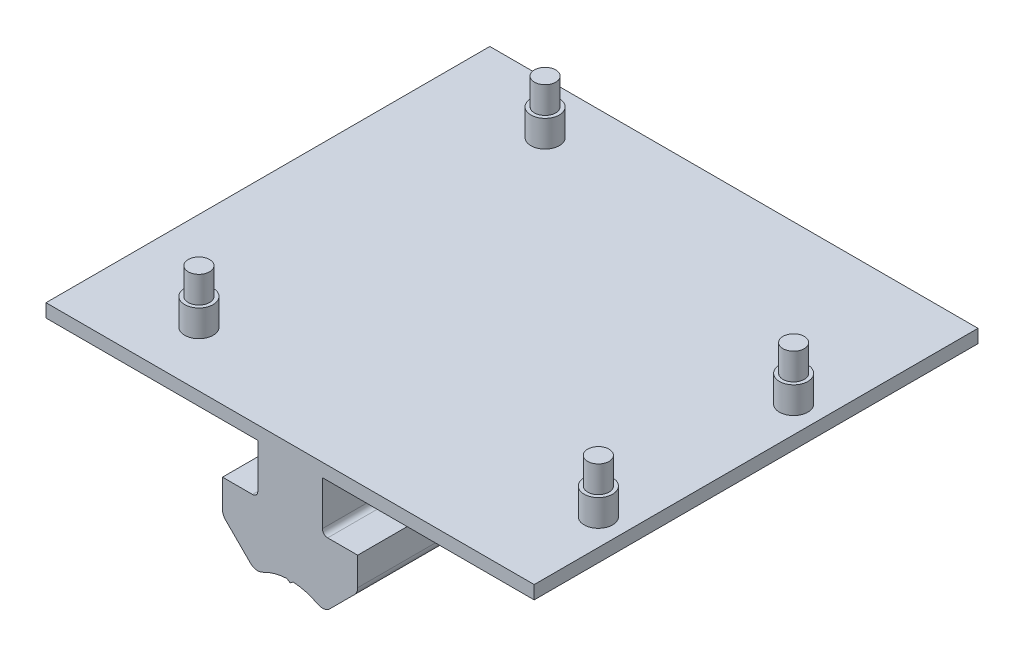
ISO-10303-21;
HEADER;
FILE_DESCRIPTION(('STEP AP214'),'2;1');
FILE_NAME('part.step','',(''),(''),'','','');
FILE_SCHEMA(('AUTOMOTIVE_DESIGN { 1 0 10303 214 1 1 1 1 }'));
ENDSEC;
DATA;
#1=APPLICATION_CONTEXT('core data for automotive mechanical design processes');
#2=APPLICATION_PROTOCOL_DEFINITION('international standard','automotive_design',2000,#1);
#3=PRODUCT_CONTEXT('',#1,'mechanical');
#4=PRODUCT('Part','Part','',(#3));
#5=PRODUCT_RELATED_PRODUCT_CATEGORY('part','',(#4));
#6=PRODUCT_DEFINITION_FORMATION('','',#4);
#7=PRODUCT_DEFINITION_CONTEXT('part definition',#1,'design');
#8=PRODUCT_DEFINITION('design','',#6,#7);
#9=PRODUCT_DEFINITION_SHAPE('','',#8);
#10=(LENGTH_UNIT() NAMED_UNIT(*) SI_UNIT(.MILLI.,.METRE.));
#11=(NAMED_UNIT(*) PLANE_ANGLE_UNIT() SI_UNIT($,.RADIAN.));
#12=(NAMED_UNIT(*) SI_UNIT($,.STERADIAN.) SOLID_ANGLE_UNIT());
#13=UNCERTAINTY_MEASURE_WITH_UNIT(LENGTH_MEASURE(1.E-05),#10,'distance_accuracy_value','');
#14=(GEOMETRIC_REPRESENTATION_CONTEXT(3) GLOBAL_UNCERTAINTY_ASSIGNED_CONTEXT((#13)) GLOBAL_UNIT_ASSIGNED_CONTEXT((#10,
#11,#12)) REPRESENTATION_CONTEXT('',''));
#15=CARTESIAN_POINT('',(0.,0.,0.));
#16=DIRECTION('',(0.,0.,1.));
#17=DIRECTION('',(1.,0.,0.));
#18=AXIS2_PLACEMENT_3D('',#15,#16,#17);
#19=CARTESIAN_POINT('',(-15.7881502716479,70.5217865494155,370.226101294247));
#20=DIRECTION('',(-1.,0.,0.));
#21=DIRECTION('',(0.,0.,1.));
#22=AXIS2_PLACEMENT_3D('',#19,#20,#21);
#23=PLANE('',#22);
#24=DIRECTION('',(0.,-1.,0.));
#25=VECTOR('',#24,1.);
#26=CARTESIAN_POINT('',(-15.7881502716479,70.5217865494155,433.726101294247));
#27=LINE('',#26,#25);
#28=CARTESIAN_POINT('',(-15.7881502716479,72.4267865494155,433.726101294247));
#29=VERTEX_POINT('',#28);
#30=CARTESIAN_POINT('',(-15.7881502716479,70.5217865494155,433.726101294247));
#31=VERTEX_POINT('',#30);
#32=EDGE_CURVE('E226',#29,#31,#27,.T.);
#33=ORIENTED_EDGE('',*,*,#32,.F.);
#34=DIRECTION('',(0.,0.,1.));
#35=VECTOR('',#34,1.);
#36=CARTESIAN_POINT('',(-15.7881502716479,72.4267865494155,370.226101294247));
#37=LINE('',#36,#35);
#38=CARTESIAN_POINT('',(-15.7881502716479,72.4267865494155,370.226101294247));
#39=VERTEX_POINT('',#38);
#40=EDGE_CURVE('E11',#39,#29,#37,.T.);
#41=ORIENTED_EDGE('',*,*,#40,.F.);
#42=DIRECTION('',(0.,-1.,0.));
#43=VECTOR('',#42,1.);
#44=CARTESIAN_POINT('',(-15.7881502716479,70.5217865494155,370.226101294247));
#45=LINE('',#44,#43);
#46=CARTESIAN_POINT('',(-15.7881502716479,70.5217865494155,370.226101294247));
#47=VERTEX_POINT('',#46);
#48=EDGE_CURVE('E292',#39,#47,#45,.T.);
#49=ORIENTED_EDGE('',*,*,#48,.T.);
#50=DIRECTION('',(0.,0.,1.));
#51=VECTOR('',#50,1.);
#52=CARTESIAN_POINT('',(-15.7881502716479,70.5217865494155,370.226101294247));
#53=LINE('',#52,#51);
#54=EDGE_CURVE('E139',#47,#31,#53,.T.);
#55=ORIENTED_EDGE('',*,*,#54,.T.);
#56=EDGE_LOOP('',(#33,#41,#49,#55));
#57=FACE_BOUND('',#56,.T.);
#58=ADVANCED_FACE('F38',(#57),#23,.T.);
#59=CARTESIAN_POINT('',(-15.7881502716479,72.4267865494155,370.226101294247));
#60=DIRECTION('',(0.,1.,0.));
#61=DIRECTION('',(0.,0.,1.));
#62=AXIS2_PLACEMENT_3D('',#59,#60,#61);
#63=PLANE('',#62);
#64=CARTESIAN_POINT('',(-1.81815027164785,72.4267865494155,425.814863045515));
#65=DIRECTION('',(0.,1.,0.));
#66=DIRECTION('',(0.,0.,1.));
#67=AXIS2_PLACEMENT_3D('',#64,#65,#66);
#68=CIRCLE('',#67,2.03200000000004);
#69=CARTESIAN_POINT('',(-1.81815027164785,72.4267865494155,427.846863045515));
#70=VERTEX_POINT('',#69);
#71=EDGE_CURVE('E629',#70,#70,#68,.T.);
#72=ORIENTED_EDGE('',*,*,#71,.F.);
#73=EDGE_LOOP('',(#72));
#74=FACE_BOUND('',#73,.T.);
#75=CARTESIAN_POINT('',(50.2518497283521,72.4267865494155,420.734863045515));
#76=DIRECTION('',(0.,1.,0.));
#77=DIRECTION('',(0.,0.,1.));
#78=AXIS2_PLACEMENT_3D('',#75,#76,#77);
#79=CIRCLE('',#78,2.03199999999995);
#80=CARTESIAN_POINT('',(50.2518497283521,72.4267865494155,422.766863045515));
#81=VERTEX_POINT('',#80);
#82=EDGE_CURVE('E348',#81,#81,#79,.T.);
#83=ORIENTED_EDGE('',*,*,#82,.F.);
#84=EDGE_LOOP('',(#83));
#85=FACE_BOUND('',#84,.T.);
#86=CARTESIAN_POINT('',(50.2518497283521,72.4267865494155,392.794863045515));
#87=DIRECTION('',(0.,1.,0.));
#88=DIRECTION('',(0.,0.,1.));
#89=AXIS2_PLACEMENT_3D('',#86,#87,#88);
#90=CIRCLE('',#89,2.03199999999995);
#91=CARTESIAN_POINT('',(50.2518497283521,72.4267865494155,394.826863045515));
#92=VERTEX_POINT('',#91);
#93=EDGE_CURVE('E344',#92,#92,#90,.T.);
#94=ORIENTED_EDGE('',*,*,#93,.F.);
#95=EDGE_LOOP('',(#94));
#96=FACE_BOUND('',#95,.T.);
#97=CARTESIAN_POINT('',(-0.548150271647851,72.4267865494155,377.554863045515));
#98=DIRECTION('',(0.,1.,0.));
#99=DIRECTION('',(0.,0.,1.));
#100=AXIS2_PLACEMENT_3D('',#97,#98,#99);
#101=CIRCLE('',#100,2.03200000000004);
#102=CARTESIAN_POINT('',(-0.548150271647851,72.4267865494155,379.586863045515));
#103=VERTEX_POINT('',#102);
#104=EDGE_CURVE('E343',#103,#103,#101,.T.);
#105=ORIENTED_EDGE('',*,*,#104,.F.);
#106=EDGE_LOOP('',(#105));
#107=FACE_BOUND('',#106,.T.);
#108=DIRECTION('',(-1.,0.,0.));
#109=VECTOR('',#108,1.);
#110=CARTESIAN_POINT('',(-15.7881502716479,72.4267865494155,433.726101294247));
#111=LINE('',#110,#109);
#112=CARTESIAN_POINT('',(54.0618497283522,72.4267865494155,433.726101294247));
#113=VERTEX_POINT('',#112);
#114=EDGE_CURVE('E290',#113,#29,#111,.T.);
#115=ORIENTED_EDGE('',*,*,#114,.F.);
#116=DIRECTION('',(0.,0.,1.));
#117=VECTOR('',#116,1.);
#118=CARTESIAN_POINT('',(54.0618497283522,72.4267865494155,370.226101294247));
#119=LINE('',#118,#117);
#120=CARTESIAN_POINT('',(54.0618497283522,72.4267865494155,370.226101294247));
#121=VERTEX_POINT('',#120);
#122=EDGE_CURVE('E47',#121,#113,#119,.T.);
#123=ORIENTED_EDGE('',*,*,#122,.F.);
#124=DIRECTION('',(-1.,0.,0.));
#125=VECTOR('',#124,1.);
#126=CARTESIAN_POINT('',(-15.7881502716479,72.4267865494155,370.226101294247));
#127=LINE('',#126,#125);
#128=EDGE_CURVE('E215',#121,#39,#127,.T.);
#129=ORIENTED_EDGE('',*,*,#128,.T.);
#130=ORIENTED_EDGE('',*,*,#40,.T.);
#131=EDGE_LOOP('',(#115,#123,#129,#130));
#132=FACE_BOUND('',#131,.T.);
#133=ADVANCED_FACE('F500',(#74,#85,#96,#107,#132),#63,.T.);
#134=CARTESIAN_POINT('',(54.0618497283522,72.4267865494155,370.226101294247));
#135=DIRECTION('',(1.,0.,0.));
#136=DIRECTION('',(0.,0.,-1.));
#137=AXIS2_PLACEMENT_3D('',#134,#135,#136);
#138=PLANE('',#137);
#139=DIRECTION('',(0.,1.,0.));
#140=VECTOR('',#139,1.);
#141=CARTESIAN_POINT('',(54.0618497283522,72.4267865494155,433.726101294247));
#142=LINE('',#141,#140);
#143=CARTESIAN_POINT('',(54.0618497283522,70.5217865494155,433.726101294247));
#144=VERTEX_POINT('',#143);
#145=EDGE_CURVE('E203',#144,#113,#142,.T.);
#146=ORIENTED_EDGE('',*,*,#145,.F.);
#147=DIRECTION('',(0.,0.,1.));
#148=VECTOR('',#147,1.);
#149=CARTESIAN_POINT('',(54.0618497283522,70.5217865494155,370.226101294247));
#150=LINE('',#149,#148);
#151=CARTESIAN_POINT('',(54.0618497283522,70.5217865494155,370.226101294247));
#152=VERTEX_POINT('',#151);
#153=EDGE_CURVE('E198',#152,#144,#150,.T.);
#154=ORIENTED_EDGE('',*,*,#153,.F.);
#155=DIRECTION('',(0.,1.,0.));
#156=VECTOR('',#155,1.);
#157=CARTESIAN_POINT('',(54.0618497283522,72.4267865494155,370.226101294247));
#158=LINE('',#157,#156);
#159=EDGE_CURVE('E201',#152,#121,#158,.T.);
#160=ORIENTED_EDGE('',*,*,#159,.T.);
#161=ORIENTED_EDGE('',*,*,#122,.T.);
#162=EDGE_LOOP('',(#146,#154,#160,#161));
#163=FACE_BOUND('',#162,.T.);
#164=ADVANCED_FACE('F200',(#163),#138,.T.);
#165=CARTESIAN_POINT('',(54.0618497283522,70.5217865494155,370.226101294247));
#166=DIRECTION('',(0.,-1.,0.));
#167=DIRECTION('',(0.,0.,-1.));
#168=AXIS2_PLACEMENT_3D('',#165,#166,#167);
#169=PLANE('',#168);
#170=DIRECTION('',(1.,0.,0.));
#171=VECTOR('',#170,1.);
#172=CARTESIAN_POINT('',(54.0618497283522,70.5217865494155,433.726101294247));
#173=LINE('',#172,#171);
#174=CARTESIAN_POINT('',(23.7558497283522,70.5217865494155,433.726101294247));
#175=VERTEX_POINT('',#174);
#176=EDGE_CURVE('E287',#175,#144,#173,.T.);
#177=ORIENTED_EDGE('',*,*,#176,.F.);
#178=DIRECTION('',(0.,0.,1.));
#179=VECTOR('',#178,1.);
#180=CARTESIAN_POINT('',(23.7558497283522,70.5217865494155,370.226101294247));
#181=LINE('',#180,#179);
#182=CARTESIAN_POINT('',(23.7558497283522,70.5217865494155,370.226101294247));
#183=VERTEX_POINT('',#182);
#184=EDGE_CURVE('E208',#183,#175,#181,.T.);
#185=ORIENTED_EDGE('',*,*,#184,.F.);
#186=DIRECTION('',(1.,0.,0.));
#187=VECTOR('',#186,1.);
#188=CARTESIAN_POINT('',(54.0618497283522,70.5217865494155,370.226101294247));
#189=LINE('',#188,#187);
#190=EDGE_CURVE('E214',#183,#152,#189,.T.);
#191=ORIENTED_EDGE('',*,*,#190,.T.);
#192=ORIENTED_EDGE('',*,*,#153,.T.);
#193=EDGE_LOOP('',(#177,#185,#191,#192));
#194=FACE_BOUND('',#193,.T.);
#195=ADVANCED_FACE('F218',(#194),#169,.T.);
#196=CARTESIAN_POINT('',(23.7558497283522,70.5217865494155,370.226101294247));
#197=DIRECTION('',(1.,0.,0.));
#198=DIRECTION('',(0.,0.,-1.));
#199=AXIS2_PLACEMENT_3D('',#196,#197,#198);
#200=PLANE('',#199);
#201=DIRECTION('',(0.,1.,0.));
#202=VECTOR('',#201,1.);
#203=CARTESIAN_POINT('',(23.7558497283522,70.5217865494155,433.726101294247));
#204=LINE('',#203,#202);
#205=CARTESIAN_POINT('',(23.7558497283522,64.1972865494153,433.726101294247));
#206=VERTEX_POINT('',#205);
#207=EDGE_CURVE('E284',#206,#175,#204,.T.);
#208=ORIENTED_EDGE('',*,*,#207,.F.);
#209=DIRECTION('',(0.,0.,1.));
#210=VECTOR('',#209,1.);
#211=CARTESIAN_POINT('',(23.7558497283522,64.1972865494153,370.226101294247));
#212=LINE('',#211,#210);
#213=CARTESIAN_POINT('',(23.7558497283522,64.1972865494153,370.226101294247));
#214=VERTEX_POINT('',#213);
#215=EDGE_CURVE('E296',#214,#206,#212,.T.);
#216=ORIENTED_EDGE('',*,*,#215,.F.);
#217=DIRECTION('',(0.,1.,0.));
#218=VECTOR('',#217,1.);
#219=CARTESIAN_POINT('',(23.7558497283522,67.9817865494152,370.226101294247));
#220=LINE('',#219,#218);
#221=EDGE_CURVE('E219',#214,#183,#220,.T.);
#222=ORIENTED_EDGE('',*,*,#221,.T.);
#223=ORIENTED_EDGE('',*,*,#184,.T.);
#224=EDGE_LOOP('',(#208,#216,#222,#223));
#225=FACE_BOUND('',#224,.T.);
#226=ADVANCED_FACE('F516',(#225),#200,.T.);
#227=CARTESIAN_POINT('',(24.5138497283521,64.1972865494153,370.226101294247));
#228=DIRECTION('',(0.,0.,1.));
#229=DIRECTION('',(1.,0.,0.));
#230=AXIS2_PLACEMENT_3D('',#227,#228,#229);
#231=CYLINDRICAL_SURFACE('',#230,0.757999999999995);
#232=CARTESIAN_POINT('',(24.5138497283521,64.1972865494153,433.726101294247));
#233=DIRECTION('',(0.,0.,-1.));
#234=DIRECTION('',(1.,0.,0.));
#235=AXIS2_PLACEMENT_3D('',#232,#233,#234);
#236=CIRCLE('',#235,0.757999999999995);
#237=CARTESIAN_POINT('',(24.5138497283522,63.4392865494153,433.726101294247));
#238=VERTEX_POINT('',#237);
#239=EDGE_CURVE('E281',#238,#206,#236,.T.);
#240=ORIENTED_EDGE('',*,*,#239,.F.);
#241=DIRECTION('',(0.,0.,1.));
#242=VECTOR('',#241,1.);
#243=CARTESIAN_POINT('',(24.5138497283522,63.4392865494153,370.226101294247));
#244=LINE('',#243,#242);
#245=CARTESIAN_POINT('',(24.5138497283522,63.4392865494153,370.226101294247));
#246=VERTEX_POINT('',#245);
#247=EDGE_CURVE('E299',#246,#238,#244,.T.);
#248=ORIENTED_EDGE('',*,*,#247,.F.);
#249=CARTESIAN_POINT('',(24.5138497283521,64.1972865494153,370.226101294247));
#250=DIRECTION('',(0.,0.,-1.));
#251=DIRECTION('',(1.,0.,0.));
#252=AXIS2_PLACEMENT_3D('',#249,#250,#251);
#253=CIRCLE('',#252,0.757999999999995);
#254=EDGE_CURVE('E221',#246,#214,#253,.T.);
#255=ORIENTED_EDGE('',*,*,#254,.T.);
#256=ORIENTED_EDGE('',*,*,#215,.T.);
#257=EDGE_LOOP('',(#240,#248,#255,#256));
#258=FACE_BOUND('',#257,.T.);
#259=ADVANCED_FACE('F432',(#258),#231,.F.);
#260=CARTESIAN_POINT('',(24.5138497283522,63.4392865494153,370.226101294247));
#261=DIRECTION('',(0.,1.,0.));
#262=DIRECTION('',(0.,0.,1.));
#263=AXIS2_PLACEMENT_3D('',#260,#261,#262);
#264=PLANE('',#263);
#265=DIRECTION('',(-1.,0.,0.));
#266=VECTOR('',#265,1.);
#267=CARTESIAN_POINT('',(24.5138497283522,63.4392865494153,433.726101294247));
#268=LINE('',#267,#266);
#269=CARTESIAN_POINT('',(28.8058497283522,63.4392865494153,433.726101294247));
#270=VERTEX_POINT('',#269);
#271=EDGE_CURVE('E278',#270,#238,#268,.T.);
#272=ORIENTED_EDGE('',*,*,#271,.F.);
#273=DIRECTION('',(0.,0.,1.));
#274=VECTOR('',#273,1.);
#275=CARTESIAN_POINT('',(28.8058497283522,63.4392865494153,370.226101294247));
#276=LINE('',#275,#274);
#277=CARTESIAN_POINT('',(28.8058497283522,63.4392865494153,370.226101294247));
#278=VERTEX_POINT('',#277);
#279=EDGE_CURVE('E301',#278,#270,#276,.T.);
#280=ORIENTED_EDGE('',*,*,#279,.F.);
#281=DIRECTION('',(-1.,0.,0.));
#282=VECTOR('',#281,1.);
#283=CARTESIAN_POINT('',(24.5138497283522,63.4392865494153,370.226101294247));
#284=LINE('',#283,#282);
#285=EDGE_CURVE('E426',#278,#246,#284,.T.);
#286=ORIENTED_EDGE('',*,*,#285,.T.);
#287=ORIENTED_EDGE('',*,*,#247,.T.);
#288=EDGE_LOOP('',(#272,#280,#286,#287));
#289=FACE_BOUND('',#288,.T.);
#290=ADVANCED_FACE('F437',(#289),#264,.T.);
#291=CARTESIAN_POINT('',(28.8058497283522,63.4392865494153,370.226101294247));
#292=DIRECTION('',(1.,0.,0.));
#293=DIRECTION('',(0.,0.,-1.));
#294=AXIS2_PLACEMENT_3D('',#291,#292,#293);
#295=PLANE('',#294);
#296=DIRECTION('',(0.,1.,0.));
#297=VECTOR('',#296,1.);
#298=CARTESIAN_POINT('',(28.8058497283522,63.4392865494153,433.726101294247));
#299=LINE('',#298,#297);
#300=CARTESIAN_POINT('',(28.8058497283522,59.4010791144885,433.726101294247));
#301=VERTEX_POINT('',#300);
#302=EDGE_CURVE('E275',#301,#270,#299,.T.);
#303=ORIENTED_EDGE('',*,*,#302,.F.);
#304=DIRECTION('',(0.,0.,1.));
#305=VECTOR('',#304,1.);
#306=CARTESIAN_POINT('',(28.8058497283522,59.4010791144885,370.226101294247));
#307=LINE('',#306,#305);
#308=CARTESIAN_POINT('',(28.8058497283522,59.4010791144885,370.226101294247));
#309=VERTEX_POINT('',#308);
#310=EDGE_CURVE('E303',#309,#301,#307,.T.);
#311=ORIENTED_EDGE('',*,*,#310,.F.);
#312=DIRECTION('',(0.,1.,0.));
#313=VECTOR('',#312,1.);
#314=CARTESIAN_POINT('',(28.8058497283522,63.4392865494153,370.226101294247));
#315=LINE('',#314,#313);
#316=EDGE_CURVE('E423',#309,#278,#315,.T.);
#317=ORIENTED_EDGE('',*,*,#316,.T.);
#318=ORIENTED_EDGE('',*,*,#279,.T.);
#319=EDGE_LOOP('',(#303,#311,#317,#318));
#320=FACE_BOUND('',#319,.T.);
#321=ADVANCED_FACE('F440',(#320),#295,.T.);
#322=CARTESIAN_POINT('',(27.3018497283522,59.4010791144885,370.226101294247));
#323=DIRECTION('',(0.,0.,1.));
#324=DIRECTION('',(1.,0.,0.));
#325=AXIS2_PLACEMENT_3D('',#322,#323,#324);
#326=CYLINDRICAL_SURFACE('',#325,1.504);
#327=CARTESIAN_POINT('',(27.3018497283522,59.4010791144885,433.726101294247));
#328=DIRECTION('',(0.,0.,1.));
#329=DIRECTION('',(1.,0.,0.));
#330=AXIS2_PLACEMENT_3D('',#327,#328,#329);
#331=CIRCLE('',#330,1.504);
#332=CARTESIAN_POINT('',(28.3653383272567,58.337590515584,433.726101294247));
#333=VERTEX_POINT('',#332);
#334=EDGE_CURVE('E272',#333,#301,#331,.T.);
#335=ORIENTED_EDGE('',*,*,#334,.F.);
#336=DIRECTION('',(0.,0.,1.));
#337=VECTOR('',#336,1.);
#338=CARTESIAN_POINT('',(28.3653383272567,58.337590515584,370.226101294247));
#339=LINE('',#338,#337);
#340=CARTESIAN_POINT('',(28.3653383272567,58.337590515584,370.226101294247));
#341=VERTEX_POINT('',#340);
#342=EDGE_CURVE('E305',#341,#333,#339,.T.);
#343=ORIENTED_EDGE('',*,*,#342,.F.);
#344=CARTESIAN_POINT('',(27.3018497283522,59.4010791144885,370.226101294247));
#345=DIRECTION('',(0.,0.,1.));
#346=DIRECTION('',(1.,0.,0.));
#347=AXIS2_PLACEMENT_3D('',#344,#345,#346);
#348=CIRCLE('',#347,1.504);
#349=EDGE_CURVE('E420',#341,#309,#348,.T.);
#350=ORIENTED_EDGE('',*,*,#349,.T.);
#351=ORIENTED_EDGE('',*,*,#310,.T.);
#352=EDGE_LOOP('',(#335,#343,#350,#351));
#353=FACE_BOUND('',#352,.T.);
#354=ADVANCED_FACE('F445',(#353),#326,.T.);
#355=CARTESIAN_POINT('',(28.3653383272567,58.337590515584,370.226101294247));
#356=DIRECTION('',(0.707106781186548,-0.707106781186548,0.));
#357=DIRECTION('',(0.707106781186548,0.707106781186548,0.));
#358=AXIS2_PLACEMENT_3D('',#355,#356,#357);
#359=PLANE('',#358);
#360=DIRECTION('',(0.707106781186547,0.707106781186547,0.));
#361=VECTOR('',#360,1.);
#362=CARTESIAN_POINT('',(28.3653383272567,58.337590515584,433.726101294247));
#363=LINE('',#362,#361);
#364=CARTESIAN_POINT('',(24.8223878072485,54.7946399955758,433.726101294247));
#365=VERTEX_POINT('',#364);
#366=EDGE_CURVE('E269',#365,#333,#363,.T.);
#367=ORIENTED_EDGE('',*,*,#366,.F.);
#368=DIRECTION('',(0.,0.,1.));
#369=VECTOR('',#368,1.);
#370=CARTESIAN_POINT('',(24.8223878072485,54.7946399955758,370.226101294247));
#371=LINE('',#370,#369);
#372=CARTESIAN_POINT('',(24.8223878072485,54.7946399955758,370.226101294247));
#373=VERTEX_POINT('',#372);
#374=EDGE_CURVE('E307',#373,#365,#371,.T.);
#375=ORIENTED_EDGE('',*,*,#374,.F.);
#376=DIRECTION('',(0.707106781186547,0.707106781186547,0.));
#377=VECTOR('',#376,1.);
#378=CARTESIAN_POINT('',(28.3653383272567,58.337590515584,370.226101294247));
#379=LINE('',#378,#377);
#380=EDGE_CURVE('E417',#373,#341,#379,.T.);
#381=ORIENTED_EDGE('',*,*,#380,.T.);
#382=ORIENTED_EDGE('',*,*,#342,.T.);
#383=EDGE_LOOP('',(#367,#375,#381,#382));
#384=FACE_BOUND('',#383,.T.);
#385=ADVANCED_FACE('F448',(#384),#359,.T.);
#386=CARTESIAN_POINT('',(23.758899208344,55.8581285944804,370.226101294247));
#387=DIRECTION('',(0.,0.,1.));
#388=DIRECTION('',(1.,0.,0.));
#389=AXIS2_PLACEMENT_3D('',#386,#387,#388);
#390=CYLINDRICAL_SURFACE('',#389,1.504);
#391=CARTESIAN_POINT('',(23.758899208344,55.8581285944804,433.726101294247));
#392=DIRECTION('',(0.,0.,1.));
#393=DIRECTION('',(1.,0.,0.));
#394=AXIS2_PLACEMENT_3D('',#391,#392,#393);
#395=CIRCLE('',#394,1.504);
#396=CARTESIAN_POINT('',(23.0556556658141,54.5286683581852,433.726101294247));
#397=VERTEX_POINT('',#396);
#398=EDGE_CURVE('E266',#397,#365,#395,.T.);
#399=ORIENTED_EDGE('',*,*,#398,.F.);
#400=DIRECTION('',(0.,0.,1.));
#401=VECTOR('',#400,1.);
#402=CARTESIAN_POINT('',(23.0556556658141,54.5286683581852,370.226101294247));
#403=LINE('',#402,#401);
#404=CARTESIAN_POINT('',(23.0556556658141,54.5286683581852,370.226101294247));
#405=VERTEX_POINT('',#404);
#406=EDGE_CURVE('E309',#405,#397,#403,.T.);
#407=ORIENTED_EDGE('',*,*,#406,.F.);
#408=CARTESIAN_POINT('',(23.758899208344,55.8581285944804,370.226101294247));
#409=DIRECTION('',(0.,0.,1.));
#410=DIRECTION('',(1.,0.,0.));
#411=AXIS2_PLACEMENT_3D('',#408,#409,#410);
#412=CIRCLE('',#411,1.504);
#413=EDGE_CURVE('E414',#405,#373,#412,.T.);
#414=ORIENTED_EDGE('',*,*,#413,.T.);
#415=ORIENTED_EDGE('',*,*,#374,.T.);
#416=EDGE_LOOP('',(#399,#407,#414,#415));
#417=FACE_BOUND('',#416,.T.);
#418=ADVANCED_FACE('F453',(#417),#390,.T.);
#419=CARTESIAN_POINT('',(19.1368497283521,47.1202865494153,370.226101294247));
#420=DIRECTION('',(0.,0.,1.));
#421=DIRECTION('',(1.,0.,0.));
#422=AXIS2_PLACEMENT_3D('',#419,#420,#421);
#423=CYLINDRICAL_SURFACE('',#422,8.38099999999999);
#424=CARTESIAN_POINT('',(19.1368497283521,47.1202865494153,433.726101294247));
#425=DIRECTION('',(0.,0.,-1.));
#426=DIRECTION('',(1.,0.,0.));
#427=AXIS2_PLACEMENT_3D('',#424,#425,#426);
#428=CIRCLE('',#427,8.38099999999999);
#429=CARTESIAN_POINT('',(19.5801508375711,55.4895544461052,433.726101294247));
#430=VERTEX_POINT('',#429);
#431=EDGE_CURVE('E263',#430,#397,#428,.T.);
#432=ORIENTED_EDGE('',*,*,#431,.F.);
#433=DIRECTION('',(0.,0.,1.));
#434=VECTOR('',#433,1.);
#435=CARTESIAN_POINT('',(19.5801508375711,55.4895544461052,370.226101294247));
#436=LINE('',#435,#434);
#437=CARTESIAN_POINT('',(19.5801508375711,55.4895544461052,370.226101294247));
#438=VERTEX_POINT('',#437);
#439=EDGE_CURVE('E311',#438,#430,#436,.T.);
#440=ORIENTED_EDGE('',*,*,#439,.F.);
#441=CARTESIAN_POINT('',(19.1368497283521,47.1202865494153,370.226101294247));
#442=DIRECTION('',(0.,0.,-1.));
#443=DIRECTION('',(1.,0.,0.));
#444=AXIS2_PLACEMENT_3D('',#441,#442,#443);
#445=CIRCLE('',#444,8.38099999999999);
#446=EDGE_CURVE('E411',#438,#405,#445,.T.);
#447=ORIENTED_EDGE('',*,*,#446,.T.);
#448=ORIENTED_EDGE('',*,*,#406,.T.);
#449=EDGE_LOOP('',(#432,#440,#447,#448));
#450=FACE_BOUND('',#449,.T.);
#451=ADVANCED_FACE('F456',(#450),#423,.F.);
#452=CARTESIAN_POINT('',(19.5801508375711,55.4895544461052,370.226101294247));
#453=DIRECTION('',(0.573576436351056,-0.819152044288985,0.));
#454=DIRECTION('',(0.819152044288985,0.573576436351056,0.));
#455=AXIS2_PLACEMENT_3D('',#452,#453,#454);
#456=PLANE('',#455);
#457=DIRECTION('',(0.819152044288985,0.573576436351056,0.));
#458=VECTOR('',#457,1.);
#459=CARTESIAN_POINT('',(19.5801508375711,55.4895544461052,433.726101294247));
#460=LINE('',#459,#458);
#461=CARTESIAN_POINT('',(19.1368497283522,55.1791516677334,433.726101294247));
#462=VERTEX_POINT('',#461);
#463=EDGE_CURVE('E260',#462,#430,#460,.T.);
#464=ORIENTED_EDGE('',*,*,#463,.F.);
#465=DIRECTION('',(0.,0.,1.));
#466=VECTOR('',#465,1.);
#467=CARTESIAN_POINT('',(19.1368497283522,55.1791516677334,370.226101294247));
#468=LINE('',#467,#466);
#469=CARTESIAN_POINT('',(19.1368497283522,55.1791516677334,370.226101294247));
#470=VERTEX_POINT('',#469);
#471=EDGE_CURVE('E313',#470,#462,#468,.T.);
#472=ORIENTED_EDGE('',*,*,#471,.F.);
#473=DIRECTION('',(0.819152044288985,0.573576436351056,0.));
#474=VECTOR('',#473,1.);
#475=CARTESIAN_POINT('',(19.5801508375711,55.4895544461052,370.226101294247));
#476=LINE('',#475,#474);
#477=EDGE_CURVE('E408',#470,#438,#476,.T.);
#478=ORIENTED_EDGE('',*,*,#477,.T.);
#479=ORIENTED_EDGE('',*,*,#439,.T.);
#480=EDGE_LOOP('',(#464,#472,#478,#479));
#481=FACE_BOUND('',#480,.T.);
#482=ADVANCED_FACE('F461',(#481),#456,.T.);
#483=CARTESIAN_POINT('',(19.1368497283522,55.1791516677334,370.226101294247));
#484=DIRECTION('',(-0.57357643635105,-0.819152044288989,0.));
#485=DIRECTION('',(0.819152044288989,-0.57357643635105,0.));
#486=AXIS2_PLACEMENT_3D('',#483,#484,#485);
#487=PLANE('',#486);
#488=DIRECTION('',(0.819152044288989,-0.57357643635105,0.));
#489=VECTOR('',#488,1.);
#490=CARTESIAN_POINT('',(19.1368497283522,55.1791516677334,433.726101294247));
#491=LINE('',#490,#489);
#492=CARTESIAN_POINT('',(18.6935486191332,55.4895544461052,433.726101294247));
#493=VERTEX_POINT('',#492);
#494=EDGE_CURVE('E257',#493,#462,#491,.T.);
#495=ORIENTED_EDGE('',*,*,#494,.F.);
#496=DIRECTION('',(0.,0.,1.));
#497=VECTOR('',#496,1.);
#498=CARTESIAN_POINT('',(18.6935486191332,55.4895544461052,370.226101294247));
#499=LINE('',#498,#497);
#500=CARTESIAN_POINT('',(18.6935486191332,55.4895544461052,370.226101294247));
#501=VERTEX_POINT('',#500);
#502=EDGE_CURVE('E315',#501,#493,#499,.T.);
#503=ORIENTED_EDGE('',*,*,#502,.F.);
#504=DIRECTION('',(0.819152044288989,-0.57357643635105,0.));
#505=VECTOR('',#504,1.);
#506=CARTESIAN_POINT('',(19.1368497283522,55.1791516677334,370.226101294247));
#507=LINE('',#506,#505);
#508=EDGE_CURVE('E405',#501,#470,#507,.T.);
#509=ORIENTED_EDGE('',*,*,#508,.T.);
#510=ORIENTED_EDGE('',*,*,#471,.T.);
#511=EDGE_LOOP('',(#495,#503,#509,#510));
#512=FACE_BOUND('',#511,.T.);
#513=ADVANCED_FACE('F464',(#512),#487,.T.);
#514=CARTESIAN_POINT('',(19.1368497283521,47.1202865494153,370.226101294247));
#515=DIRECTION('',(0.,0.,1.));
#516=DIRECTION('',(1.,0.,0.));
#517=AXIS2_PLACEMENT_3D('',#514,#515,#516);
#518=CYLINDRICAL_SURFACE('',#517,8.381);
#519=CARTESIAN_POINT('',(19.1368497283521,47.1202865494153,433.726101294247));
#520=DIRECTION('',(0.,0.,-1.));
#521=DIRECTION('',(1.,0.,0.));
#522=AXIS2_PLACEMENT_3D('',#519,#520,#521);
#523=CIRCLE('',#522,8.381);
#524=CARTESIAN_POINT('',(15.2180437908902,54.5286683581852,433.726101294247));
#525=VERTEX_POINT('',#524);
#526=EDGE_CURVE('E254',#525,#493,#523,.T.);
#527=ORIENTED_EDGE('',*,*,#526,.F.);
#528=DIRECTION('',(0.,0.,1.));
#529=VECTOR('',#528,1.);
#530=CARTESIAN_POINT('',(15.2180437908902,54.5286683581852,370.226101294247));
#531=LINE('',#530,#529);
#532=CARTESIAN_POINT('',(15.2180437908902,54.5286683581852,370.226101294247));
#533=VERTEX_POINT('',#532);
#534=EDGE_CURVE('E317',#533,#525,#531,.T.);
#535=ORIENTED_EDGE('',*,*,#534,.F.);
#536=CARTESIAN_POINT('',(19.1368497283521,47.1202865494153,370.226101294247));
#537=DIRECTION('',(0.,0.,-1.));
#538=DIRECTION('',(1.,0.,0.));
#539=AXIS2_PLACEMENT_3D('',#536,#537,#538);
#540=CIRCLE('',#539,8.381);
#541=EDGE_CURVE('E402',#533,#501,#540,.T.);
#542=ORIENTED_EDGE('',*,*,#541,.T.);
#543=ORIENTED_EDGE('',*,*,#502,.T.);
#544=EDGE_LOOP('',(#527,#535,#542,#543));
#545=FACE_BOUND('',#544,.T.);
#546=ADVANCED_FACE('F469',(#545),#518,.F.);
#547=CARTESIAN_POINT('',(14.5148002483603,55.8581285944804,370.226101294247));
#548=DIRECTION('',(0.,0.,1.));
#549=DIRECTION('',(1.,0.,0.));
#550=AXIS2_PLACEMENT_3D('',#547,#548,#549);
#551=CYLINDRICAL_SURFACE('',#550,1.504);
#552=CARTESIAN_POINT('',(14.5148002483603,55.8581285944804,433.726101294247));
#553=DIRECTION('',(0.,0.,1.));
#554=DIRECTION('',(1.,0.,0.));
#555=AXIS2_PLACEMENT_3D('',#552,#553,#554);
#556=CIRCLE('',#555,1.504);
#557=CARTESIAN_POINT('',(13.4513116494558,54.7946399955758,433.726101294247));
#558=VERTEX_POINT('',#557);
#559=EDGE_CURVE('E251',#558,#525,#556,.T.);
#560=ORIENTED_EDGE('',*,*,#559,.F.);
#561=DIRECTION('',(0.,0.,1.));
#562=VECTOR('',#561,1.);
#563=CARTESIAN_POINT('',(13.4513116494558,54.7946399955758,370.226101294247));
#564=LINE('',#563,#562);
#565=CARTESIAN_POINT('',(13.4513116494558,54.7946399955758,370.226101294247));
#566=VERTEX_POINT('',#565);
#567=EDGE_CURVE('E319',#566,#558,#564,.T.);
#568=ORIENTED_EDGE('',*,*,#567,.F.);
#569=CARTESIAN_POINT('',(14.5148002483603,55.8581285944804,370.226101294247));
#570=DIRECTION('',(0.,0.,1.));
#571=DIRECTION('',(1.,0.,0.));
#572=AXIS2_PLACEMENT_3D('',#569,#570,#571);
#573=CIRCLE('',#572,1.504);
#574=EDGE_CURVE('E399',#566,#533,#573,.T.);
#575=ORIENTED_EDGE('',*,*,#574,.T.);
#576=ORIENTED_EDGE('',*,*,#534,.T.);
#577=EDGE_LOOP('',(#560,#568,#575,#576));
#578=FACE_BOUND('',#577,.T.);
#579=ADVANCED_FACE('F472',(#578),#551,.T.);
#580=CARTESIAN_POINT('',(13.4513116494558,54.7946399955758,370.226101294247));
#581=DIRECTION('',(-0.707106781186548,-0.707106781186547,0.));
#582=DIRECTION('',(0.707106781186547,-0.707106781186548,0.));
#583=AXIS2_PLACEMENT_3D('',#580,#581,#582);
#584=PLANE('',#583);
#585=DIRECTION('',(0.707106781186547,-0.707106781186548,0.));
#586=VECTOR('',#585,1.);
#587=CARTESIAN_POINT('',(13.4513116494558,54.7946399955758,433.726101294247));
#588=LINE('',#587,#586);
#589=CARTESIAN_POINT('',(9.90836112944758,58.337590515584,433.726101294247));
#590=VERTEX_POINT('',#589);
#591=EDGE_CURVE('E248',#590,#558,#588,.T.);
#592=ORIENTED_EDGE('',*,*,#591,.F.);
#593=DIRECTION('',(0.,0.,1.));
#594=VECTOR('',#593,1.);
#595=CARTESIAN_POINT('',(9.90836112944758,58.337590515584,370.226101294247));
#596=LINE('',#595,#594);
#597=CARTESIAN_POINT('',(9.90836112944758,58.337590515584,370.226101294247));
#598=VERTEX_POINT('',#597);
#599=EDGE_CURVE('E321',#598,#590,#596,.T.);
#600=ORIENTED_EDGE('',*,*,#599,.F.);
#601=DIRECTION('',(0.707106781186547,-0.707106781186548,0.));
#602=VECTOR('',#601,1.);
#603=CARTESIAN_POINT('',(13.4513116494558,54.7946399955758,370.226101294247));
#604=LINE('',#603,#602);
#605=EDGE_CURVE('E396',#598,#566,#604,.T.);
#606=ORIENTED_EDGE('',*,*,#605,.T.);
#607=ORIENTED_EDGE('',*,*,#567,.T.);
#608=EDGE_LOOP('',(#592,#600,#606,#607));
#609=FACE_BOUND('',#608,.T.);
#610=ADVANCED_FACE('F477',(#609),#584,.T.);
#611=CARTESIAN_POINT('',(10.9718497283522,59.4010791144885,370.226101294247));
#612=DIRECTION('',(0.,0.,1.));
#613=DIRECTION('',(1.,0.,0.));
#614=AXIS2_PLACEMENT_3D('',#611,#612,#613);
#615=CYLINDRICAL_SURFACE('',#614,1.504);
#616=CARTESIAN_POINT('',(10.9718497283522,59.4010791144885,433.726101294247));
#617=DIRECTION('',(0.,0.,1.));
#618=DIRECTION('',(1.,0.,0.));
#619=AXIS2_PLACEMENT_3D('',#616,#617,#618);
#620=CIRCLE('',#619,1.504);
#621=CARTESIAN_POINT('',(9.46784972835215,59.4010791144885,433.726101294247));
#622=VERTEX_POINT('',#621);
#623=EDGE_CURVE('E245',#622,#590,#620,.T.);
#624=ORIENTED_EDGE('',*,*,#623,.F.);
#625=DIRECTION('',(0.,0.,1.));
#626=VECTOR('',#625,1.);
#627=CARTESIAN_POINT('',(9.46784972835215,59.4010791144885,370.226101294247));
#628=LINE('',#627,#626);
#629=CARTESIAN_POINT('',(9.46784972835215,59.4010791144885,370.226101294247));
#630=VERTEX_POINT('',#629);
#631=EDGE_CURVE('E323',#630,#622,#628,.T.);
#632=ORIENTED_EDGE('',*,*,#631,.F.);
#633=CARTESIAN_POINT('',(10.9718497283522,59.4010791144885,370.226101294247));
#634=DIRECTION('',(0.,0.,1.));
#635=DIRECTION('',(1.,0.,0.));
#636=AXIS2_PLACEMENT_3D('',#633,#634,#635);
#637=CIRCLE('',#636,1.504);
#638=EDGE_CURVE('E393',#630,#598,#637,.T.);
#639=ORIENTED_EDGE('',*,*,#638,.T.);
#640=ORIENTED_EDGE('',*,*,#599,.T.);
#641=EDGE_LOOP('',(#624,#632,#639,#640));
#642=FACE_BOUND('',#641,.T.);
#643=ADVANCED_FACE('F480',(#642),#615,.T.);
#644=CARTESIAN_POINT('',(9.46784972835215,59.4010791144885,370.226101294247));
#645=DIRECTION('',(-1.,0.,0.));
#646=DIRECTION('',(0.,0.,1.));
#647=AXIS2_PLACEMENT_3D('',#644,#645,#646);
#648=PLANE('',#647);
#649=DIRECTION('',(0.,-1.,0.));
#650=VECTOR('',#649,1.);
#651=CARTESIAN_POINT('',(9.46784972835215,59.4010791144885,433.726101294247));
#652=LINE('',#651,#650);
#653=CARTESIAN_POINT('',(9.46784972835215,63.4392865494153,433.726101294247));
#654=VERTEX_POINT('',#653);
#655=EDGE_CURVE('E242',#654,#622,#652,.T.);
#656=ORIENTED_EDGE('',*,*,#655,.F.);
#657=DIRECTION('',(0.,0.,1.));
#658=VECTOR('',#657,1.);
#659=CARTESIAN_POINT('',(9.46784972835215,63.4392865494153,370.226101294247));
#660=LINE('',#659,#658);
#661=CARTESIAN_POINT('',(9.46784972835215,63.4392865494153,370.226101294247));
#662=VERTEX_POINT('',#661);
#663=EDGE_CURVE('E325',#662,#654,#660,.T.);
#664=ORIENTED_EDGE('',*,*,#663,.F.);
#665=DIRECTION('',(0.,-1.,0.));
#666=VECTOR('',#665,1.);
#667=CARTESIAN_POINT('',(9.46784972835215,59.4010791144885,370.226101294247));
#668=LINE('',#667,#666);
#669=EDGE_CURVE('E390',#662,#630,#668,.T.);
#670=ORIENTED_EDGE('',*,*,#669,.T.);
#671=ORIENTED_EDGE('',*,*,#631,.T.);
#672=EDGE_LOOP('',(#656,#664,#670,#671));
#673=FACE_BOUND('',#672,.T.);
#674=ADVANCED_FACE('F486',(#673),#648,.T.);
#675=CARTESIAN_POINT('',(9.46784972835215,63.4392865494153,370.226101294247));
#676=DIRECTION('',(0.,1.,0.));
#677=DIRECTION('',(-1.,0.,0.));
#678=AXIS2_PLACEMENT_3D('',#675,#676,#677);
#679=PLANE('',#678);
#680=DIRECTION('',(-1.,0.,0.));
#681=VECTOR('',#680,1.);
#682=CARTESIAN_POINT('',(9.46784972835215,63.4392865494153,433.726101294247));
#683=LINE('',#682,#681);
#684=CARTESIAN_POINT('',(13.7598497283522,63.4392865494153,433.726101294247));
#685=VERTEX_POINT('',#684);
#686=EDGE_CURVE('E239',#685,#654,#683,.T.);
#687=ORIENTED_EDGE('',*,*,#686,.F.);
#688=DIRECTION('',(0.,0.,1.));
#689=VECTOR('',#688,1.);
#690=CARTESIAN_POINT('',(13.7598497283522,63.4392865494153,370.226101294247));
#691=LINE('',#690,#689);
#692=CARTESIAN_POINT('',(13.7598497283522,63.4392865494153,370.226101294247));
#693=VERTEX_POINT('',#692);
#694=EDGE_CURVE('E327',#693,#685,#691,.T.);
#695=ORIENTED_EDGE('',*,*,#694,.F.);
#696=DIRECTION('',(-1.,0.,0.));
#697=VECTOR('',#696,1.);
#698=CARTESIAN_POINT('',(12.817159361088,63.4392865494153,370.226101294247));
#699=LINE('',#698,#697);
#700=EDGE_CURVE('E388',#693,#662,#699,.T.);
#701=ORIENTED_EDGE('',*,*,#700,.T.);
#702=ORIENTED_EDGE('',*,*,#663,.T.);
#703=EDGE_LOOP('',(#687,#695,#701,#702));
#704=FACE_BOUND('',#703,.T.);
#705=ADVANCED_FACE('F488',(#704),#679,.T.);
#706=CARTESIAN_POINT('',(13.7598497283522,64.1972865494153,370.226101294247));
#707=DIRECTION('',(0.,0.,1.));
#708=DIRECTION('',(1.,0.,0.));
#709=AXIS2_PLACEMENT_3D('',#706,#707,#708);
#710=CYLINDRICAL_SURFACE('',#709,0.757999999999997);
#711=CARTESIAN_POINT('',(13.7598497283522,64.1972865494153,433.726101294247));
#712=DIRECTION('',(0.,0.,-1.));
#713=DIRECTION('',(1.,0.,0.));
#714=AXIS2_PLACEMENT_3D('',#711,#712,#713);
#715=CIRCLE('',#714,0.757999999999997);
#716=CARTESIAN_POINT('',(14.5178497283521,64.1972865494153,433.726101294247));
#717=VERTEX_POINT('',#716);
#718=EDGE_CURVE('E236',#717,#685,#715,.T.);
#719=ORIENTED_EDGE('',*,*,#718,.F.);
#720=DIRECTION('',(0.,0.,1.));
#721=VECTOR('',#720,1.);
#722=CARTESIAN_POINT('',(14.5178497283521,64.1972865494153,370.226101294247));
#723=LINE('',#722,#721);
#724=CARTESIAN_POINT('',(14.5178497283521,64.1972865494153,370.226101294247));
#725=VERTEX_POINT('',#724);
#726=EDGE_CURVE('E330',#725,#717,#723,.T.);
#727=ORIENTED_EDGE('',*,*,#726,.F.);
#728=CARTESIAN_POINT('',(13.7598497283522,64.1972865494153,370.226101294247));
#729=DIRECTION('',(0.,0.,-1.));
#730=DIRECTION('',(1.,0.,0.));
#731=AXIS2_PLACEMENT_3D('',#728,#729,#730);
#732=CIRCLE('',#731,0.757999999999997);
#733=EDGE_CURVE('E385',#725,#693,#732,.T.);
#734=ORIENTED_EDGE('',*,*,#733,.T.);
#735=ORIENTED_EDGE('',*,*,#694,.T.);
#736=EDGE_LOOP('',(#719,#727,#734,#735));
#737=FACE_BOUND('',#736,.T.);
#738=ADVANCED_FACE('F494',(#737),#710,.F.);
#739=CARTESIAN_POINT('',(14.5178497283521,64.1972865494153,370.226101294247));
#740=DIRECTION('',(-1.,0.,0.));
#741=DIRECTION('',(0.,0.,1.));
#742=AXIS2_PLACEMENT_3D('',#739,#740,#741);
#743=PLANE('',#742);
#744=DIRECTION('',(0.,-1.,0.));
#745=VECTOR('',#744,1.);
#746=CARTESIAN_POINT('',(14.5178497283521,64.1972865494153,433.726101294247));
#747=LINE('',#746,#745);
#748=CARTESIAN_POINT('',(14.5178497283521,70.5217865494155,433.726101294247));
#749=VERTEX_POINT('',#748);
#750=EDGE_CURVE('E233',#749,#717,#747,.T.);
#751=ORIENTED_EDGE('',*,*,#750,.F.);
#752=DIRECTION('',(0.,0.,1.));
#753=VECTOR('',#752,1.);
#754=CARTESIAN_POINT('',(14.5178497283521,70.5217865494155,370.226101294247));
#755=LINE('',#754,#753);
#756=CARTESIAN_POINT('',(14.5178497283521,70.5217865494155,370.226101294247));
#757=VERTEX_POINT('',#756);
#758=EDGE_CURVE('E332',#757,#749,#755,.T.);
#759=ORIENTED_EDGE('',*,*,#758,.F.);
#760=DIRECTION('',(0.,-1.,0.));
#761=VECTOR('',#760,1.);
#762=CARTESIAN_POINT('',(14.5178497283521,67.9817865494152,370.226101294247));
#763=LINE('',#762,#761);
#764=EDGE_CURVE('E383',#757,#725,#763,.T.);
#765=ORIENTED_EDGE('',*,*,#764,.T.);
#766=ORIENTED_EDGE('',*,*,#726,.T.);
#767=EDGE_LOOP('',(#751,#759,#765,#766));
#768=FACE_BOUND('',#767,.T.);
#769=ADVANCED_FACE('F496',(#768),#743,.T.);
#770=CARTESIAN_POINT('',(14.5178497283521,70.5217865494155,370.226101294247));
#771=DIRECTION('',(0.,-1.,0.));
#772=DIRECTION('',(0.,0.,-1.));
#773=AXIS2_PLACEMENT_3D('',#770,#771,#772);
#774=PLANE('',#773);
#775=DIRECTION('',(1.,0.,0.));
#776=VECTOR('',#775,1.);
#777=CARTESIAN_POINT('',(14.5178497283521,70.5217865494155,433.726101294247));
#778=LINE('',#777,#776);
#779=EDGE_CURVE('E229',#31,#749,#778,.T.);
#780=ORIENTED_EDGE('',*,*,#779,.F.);
#781=ORIENTED_EDGE('',*,*,#54,.F.);
#782=DIRECTION('',(1.,0.,0.));
#783=VECTOR('',#782,1.);
#784=CARTESIAN_POINT('',(14.5178497283521,70.5217865494155,370.226101294247));
#785=LINE('',#784,#783);
#786=EDGE_CURVE('E381',#47,#757,#785,.T.);
#787=ORIENTED_EDGE('',*,*,#786,.T.);
#788=ORIENTED_EDGE('',*,*,#758,.T.);
#789=EDGE_LOOP('',(#780,#781,#787,#788));
#790=FACE_BOUND('',#789,.T.);
#791=ADVANCED_FACE('F497',(#790),#774,.T.);
#792=CARTESIAN_POINT('',(24.5138497283521,64.1972865494153,370.226101294247));
#793=DIRECTION('',(0.,0.,1.));
#794=DIRECTION('',(1.,0.,0.));
#795=AXIS2_PLACEMENT_3D('',#792,#793,#794);
#796=PLANE('',#795);
#797=ORIENTED_EDGE('',*,*,#48,.F.);
#798=ORIENTED_EDGE('',*,*,#128,.F.);
#799=ORIENTED_EDGE('',*,*,#159,.F.);
#800=ORIENTED_EDGE('',*,*,#190,.F.);
#801=ORIENTED_EDGE('',*,*,#221,.F.);
#802=ORIENTED_EDGE('',*,*,#254,.F.);
#803=ORIENTED_EDGE('',*,*,#285,.F.);
#804=ORIENTED_EDGE('',*,*,#316,.F.);
#805=ORIENTED_EDGE('',*,*,#349,.F.);
#806=ORIENTED_EDGE('',*,*,#380,.F.);
#807=ORIENTED_EDGE('',*,*,#413,.F.);
#808=ORIENTED_EDGE('',*,*,#446,.F.);
#809=ORIENTED_EDGE('',*,*,#477,.F.);
#810=ORIENTED_EDGE('',*,*,#508,.F.);
#811=ORIENTED_EDGE('',*,*,#541,.F.);
#812=ORIENTED_EDGE('',*,*,#574,.F.);
#813=ORIENTED_EDGE('',*,*,#605,.F.);
#814=ORIENTED_EDGE('',*,*,#638,.F.);
#815=ORIENTED_EDGE('',*,*,#669,.F.);
#816=ORIENTED_EDGE('',*,*,#700,.F.);
#817=ORIENTED_EDGE('',*,*,#733,.F.);
#818=ORIENTED_EDGE('',*,*,#764,.F.);
#819=ORIENTED_EDGE('',*,*,#786,.F.);
#820=EDGE_LOOP('',(#797,#798,#799,#800,#801,#802,#803,#804,#805,#806,#807,#808,#809,#810,#811,
#812,#813,#814,#815,#816,#817,#818,#819));
#821=FACE_BOUND('',#820,.T.);
#822=ADVANCED_FACE('F212',(#821),#796,.F.);
#823=CARTESIAN_POINT('',(24.5138497283521,64.1972865494153,433.726101294247));
#824=DIRECTION('',(0.,0.,1.));
#825=DIRECTION('',(1.,0.,0.));
#826=AXIS2_PLACEMENT_3D('',#823,#824,#825);
#827=PLANE('',#826);
#828=ORIENTED_EDGE('',*,*,#32,.T.);
#829=ORIENTED_EDGE('',*,*,#779,.T.);
#830=ORIENTED_EDGE('',*,*,#750,.T.);
#831=ORIENTED_EDGE('',*,*,#718,.T.);
#832=ORIENTED_EDGE('',*,*,#686,.T.);
#833=ORIENTED_EDGE('',*,*,#655,.T.);
#834=ORIENTED_EDGE('',*,*,#623,.T.);
#835=ORIENTED_EDGE('',*,*,#591,.T.);
#836=ORIENTED_EDGE('',*,*,#559,.T.);
#837=ORIENTED_EDGE('',*,*,#526,.T.);
#838=ORIENTED_EDGE('',*,*,#494,.T.);
#839=ORIENTED_EDGE('',*,*,#463,.T.);
#840=ORIENTED_EDGE('',*,*,#431,.T.);
#841=ORIENTED_EDGE('',*,*,#398,.T.);
#842=ORIENTED_EDGE('',*,*,#366,.T.);
#843=ORIENTED_EDGE('',*,*,#334,.T.);
#844=ORIENTED_EDGE('',*,*,#302,.T.);
#845=ORIENTED_EDGE('',*,*,#271,.T.);
#846=ORIENTED_EDGE('',*,*,#239,.T.);
#847=ORIENTED_EDGE('',*,*,#207,.T.);
#848=ORIENTED_EDGE('',*,*,#176,.T.);
#849=ORIENTED_EDGE('',*,*,#145,.T.);
#850=ORIENTED_EDGE('',*,*,#114,.T.);
#851=EDGE_LOOP('',(#828,#829,#830,#831,#832,#833,#834,#835,#836,#837,#838,#839,#840,#841,#842,
#843,#844,#845,#846,#847,#848,#849,#850));
#852=FACE_BOUND('',#851,.T.);
#853=ADVANCED_FACE('F499',(#852),#827,.T.);
#854=CARTESIAN_POINT('',(-0.548150271647851,76.2367865494155,377.554863045515));
#855=DIRECTION('',(0.,-1.,0.));
#856=DIRECTION('',(0.,0.,-1.));
#857=AXIS2_PLACEMENT_3D('',#854,#855,#856);
#858=CYLINDRICAL_SURFACE('',#857,2.03200000000004);
#859=CARTESIAN_POINT('',(-0.548150271647851,76.2367865494155,377.554863045515));
#860=DIRECTION('',(0.,1.,0.));
#861=DIRECTION('',(0.,0.,1.));
#862=AXIS2_PLACEMENT_3D('',#859,#860,#861);
#863=CIRCLE('',#862,2.03200000000004);
#864=CARTESIAN_POINT('',(-0.548150271647851,76.2367865494155,379.586863045515));
#865=VERTEX_POINT('',#864);
#866=EDGE_CURVE('E340',#865,#865,#863,.T.);
#867=ORIENTED_EDGE('',*,*,#866,.F.);
#868=EDGE_LOOP('',(#867));
#869=FACE_BOUND('',#868,.T.);
#870=ORIENTED_EDGE('',*,*,#104,.T.);
#871=EDGE_LOOP('',(#870));
#872=FACE_BOUND('',#871,.T.);
#873=ADVANCED_FACE('F560',(#869,#872),#858,.T.);
#874=CARTESIAN_POINT('',(-0.548150271647851,76.2367865494155,377.554863045515));
#875=DIRECTION('',(0.,1.,0.));
#876=DIRECTION('',(0.,0.,1.));
#877=AXIS2_PLACEMENT_3D('',#874,#875,#876);
#878=PLANE('',#877);
#879=CARTESIAN_POINT('',(-0.548150271647851,76.2367865494155,377.554863045515));
#880=DIRECTION('',(0.,1.,0.));
#881=DIRECTION('',(0.,0.,1.));
#882=AXIS2_PLACEMENT_3D('',#879,#880,#881);
#883=CIRCLE('',#882,1.52400000000002);
#884=CARTESIAN_POINT('',(-0.548150271647851,76.2367865494155,379.078863045515));
#885=VERTEX_POINT('',#884);
#886=EDGE_CURVE('E336',#885,#885,#883,.T.);
#887=ORIENTED_EDGE('',*,*,#886,.F.);
#888=EDGE_LOOP('',(#887));
#889=FACE_BOUND('',#888,.T.);
#890=ORIENTED_EDGE('',*,*,#866,.T.);
#891=EDGE_LOOP('',(#890));
#892=FACE_BOUND('',#891,.T.);
#893=ADVANCED_FACE('F570',(#889,#892),#878,.T.);
#894=CARTESIAN_POINT('',(-0.548150271647851,80.0467865494155,377.554863045515));
#895=DIRECTION('',(0.,1.,0.));
#896=DIRECTION('',(0.,0.,1.));
#897=AXIS2_PLACEMENT_3D('',#894,#895,#896);
#898=PLANE('',#897);
#899=CARTESIAN_POINT('',(-0.548150271647851,80.0467865494155,377.554863045515));
#900=DIRECTION('',(0.,1.,0.));
#901=DIRECTION('',(0.,0.,1.));
#902=AXIS2_PLACEMENT_3D('',#899,#900,#901);
#903=CIRCLE('',#902,1.52400000000002);
#904=CARTESIAN_POINT('',(-0.548150271647851,80.0467865494155,379.078863045515));
#905=VERTEX_POINT('',#904);
#906=EDGE_CURVE('E230',#905,#905,#903,.T.);
#907=ORIENTED_EDGE('',*,*,#906,.T.);
#908=EDGE_LOOP('',(#907));
#909=FACE_BOUND('',#908,.T.);
#910=ADVANCED_FACE('F566',(#909),#898,.T.);
#911=CARTESIAN_POINT('',(-0.548150271647851,80.0467865494155,377.554863045515));
#912=DIRECTION('',(0.,-1.,0.));
#913=DIRECTION('',(0.,0.,-1.));
#914=AXIS2_PLACEMENT_3D('',#911,#912,#913);
#915=CYLINDRICAL_SURFACE('',#914,1.52400000000002);
#916=ORIENTED_EDGE('',*,*,#886,.T.);
#917=EDGE_LOOP('',(#916));
#918=FACE_BOUND('',#917,.T.);
#919=ORIENTED_EDGE('',*,*,#906,.F.);
#920=EDGE_LOOP('',(#919));
#921=FACE_BOUND('',#920,.T.);
#922=ADVANCED_FACE('F562',(#918,#921),#915,.T.);
#923=CARTESIAN_POINT('',(50.2518497283521,76.2367865494155,392.794863045515));
#924=DIRECTION('',(0.,-1.,0.));
#925=DIRECTION('',(0.,0.,-1.));
#926=AXIS2_PLACEMENT_3D('',#923,#924,#925);
#927=CYLINDRICAL_SURFACE('',#926,2.03199999999995);
#928=CARTESIAN_POINT('',(50.2518497283521,76.2367865494155,392.794863045515));
#929=DIRECTION('',(0.,1.,0.));
#930=DIRECTION('',(0.,0.,1.));
#931=AXIS2_PLACEMENT_3D('',#928,#929,#930);
#932=CIRCLE('',#931,2.03199999999995);
#933=CARTESIAN_POINT('',(50.2518497283521,76.2367865494155,394.826863045515));
#934=VERTEX_POINT('',#933);
#935=EDGE_CURVE('E347',#934,#934,#932,.T.);
#936=ORIENTED_EDGE('',*,*,#935,.F.);
#937=EDGE_LOOP('',(#936));
#938=FACE_BOUND('',#937,.T.);
#939=ORIENTED_EDGE('',*,*,#93,.T.);
#940=EDGE_LOOP('',(#939));
#941=FACE_BOUND('',#940,.T.);
#942=ADVANCED_FACE('F565',(#938,#941),#927,.T.);
#943=CARTESIAN_POINT('',(50.2518497283521,76.2367865494155,392.794863045515));
#944=DIRECTION('',(0.,1.,0.));
#945=DIRECTION('',(0.,0.,1.));
#946=AXIS2_PLACEMENT_3D('',#943,#944,#945);
#947=PLANE('',#946);
#948=CARTESIAN_POINT('',(50.2518497283521,76.2367865494155,392.794863045515));
#949=DIRECTION('',(0.,1.,0.));
#950=DIRECTION('',(0.,0.,1.));
#951=AXIS2_PLACEMENT_3D('',#948,#949,#950);
#952=CIRCLE('',#951,1.52399999999998);
#953=CARTESIAN_POINT('',(50.2518497283521,76.2367865494155,394.318863045515));
#954=VERTEX_POINT('',#953);
#955=EDGE_CURVE('E341',#954,#954,#952,.T.);
#956=ORIENTED_EDGE('',*,*,#955,.F.);
#957=EDGE_LOOP('',(#956));
#958=FACE_BOUND('',#957,.T.);
#959=ORIENTED_EDGE('',*,*,#935,.T.);
#960=EDGE_LOOP('',(#959));
#961=FACE_BOUND('',#960,.T.);
#962=ADVANCED_FACE('F576',(#958,#961),#947,.T.);
#963=CARTESIAN_POINT('',(50.2518497283521,80.0467865494155,392.794863045515));
#964=DIRECTION('',(0.,1.,0.));
#965=DIRECTION('',(0.,0.,1.));
#966=AXIS2_PLACEMENT_3D('',#963,#964,#965);
#967=PLANE('',#966);
#968=CARTESIAN_POINT('',(50.2518497283521,80.0467865494155,392.794863045515));
#969=DIRECTION('',(0.,1.,0.));
#970=DIRECTION('',(0.,0.,1.));
#971=AXIS2_PLACEMENT_3D('',#968,#969,#970);
#972=CIRCLE('',#971,1.52399999999998);
#973=CARTESIAN_POINT('',(50.2518497283521,80.0467865494155,394.318863045515));
#974=VERTEX_POINT('',#973);
#975=EDGE_CURVE('E375',#974,#974,#972,.T.);
#976=ORIENTED_EDGE('',*,*,#975,.T.);
#977=EDGE_LOOP('',(#976));
#978=FACE_BOUND('',#977,.T.);
#979=ADVANCED_FACE('F572',(#978),#967,.T.);
#980=CARTESIAN_POINT('',(50.2518497283521,80.0467865494155,392.794863045515));
#981=DIRECTION('',(0.,-1.,0.));
#982=DIRECTION('',(0.,0.,-1.));
#983=AXIS2_PLACEMENT_3D('',#980,#981,#982);
#984=CYLINDRICAL_SURFACE('',#983,1.52399999999998);
#985=ORIENTED_EDGE('',*,*,#955,.T.);
#986=EDGE_LOOP('',(#985));
#987=FACE_BOUND('',#986,.T.);
#988=ORIENTED_EDGE('',*,*,#975,.F.);
#989=EDGE_LOOP('',(#988));
#990=FACE_BOUND('',#989,.T.);
#991=ADVANCED_FACE('F575',(#987,#990),#984,.T.);
#992=CARTESIAN_POINT('',(50.2518497283521,76.2367865494155,420.734863045515));
#993=DIRECTION('',(0.,-1.,0.));
#994=DIRECTION('',(0.,0.,-1.));
#995=AXIS2_PLACEMENT_3D('',#992,#993,#994);
#996=CYLINDRICAL_SURFACE('',#995,2.03199999999995);
#997=CARTESIAN_POINT('',(50.2518497283521,76.2367865494155,420.734863045515));
#998=DIRECTION('',(0.,1.,0.));
#999=DIRECTION('',(0.,0.,1.));
#1000=AXIS2_PLACEMENT_3D('',#997,#998,#999);
#1001=CIRCLE('',#1000,2.03199999999995);
#1002=CARTESIAN_POINT('',(50.2518497283521,76.2367865494155,422.766863045515));
#1003=VERTEX_POINT('',#1002);
#1004=EDGE_CURVE('E354',#1003,#1003,#1001,.T.);
#1005=ORIENTED_EDGE('',*,*,#1004,.F.);
#1006=EDGE_LOOP('',(#1005));
#1007=FACE_BOUND('',#1006,.T.);
#1008=ORIENTED_EDGE('',*,*,#82,.T.);
#1009=EDGE_LOOP('',(#1008));
#1010=FACE_BOUND('',#1009,.T.);
#1011=ADVANCED_FACE('F580',(#1007,#1010),#996,.T.);
#1012=CARTESIAN_POINT('',(50.2518497283521,76.2367865494155,420.734863045515));
#1013=DIRECTION('',(0.,1.,0.));
#1014=DIRECTION('',(0.,0.,1.));
#1015=AXIS2_PLACEMENT_3D('',#1012,#1013,#1014);
#1016=PLANE('',#1015);
#1017=CARTESIAN_POINT('',(50.2518497283521,76.2367865494155,420.734863045515));
#1018=DIRECTION('',(0.,1.,0.));
#1019=DIRECTION('',(0.,0.,1.));
#1020=AXIS2_PLACEMENT_3D('',#1017,#1018,#1019);
#1021=CIRCLE('',#1020,1.52399999999998);
#1022=CARTESIAN_POINT('',(50.2518497283521,76.2367865494155,422.258863045515));
#1023=VERTEX_POINT('',#1022);
#1024=EDGE_CURVE('E345',#1023,#1023,#1021,.T.);
#1025=ORIENTED_EDGE('',*,*,#1024,.F.);
#1026=EDGE_LOOP('',(#1025));
#1027=FACE_BOUND('',#1026,.T.);
#1028=ORIENTED_EDGE('',*,*,#1004,.T.);
#1029=EDGE_LOOP('',(#1028));
#1030=FACE_BOUND('',#1029,.T.);
#1031=ADVANCED_FACE('F586',(#1027,#1030),#1016,.T.);
#1032=CARTESIAN_POINT('',(50.2518497283521,80.0467865494155,420.734863045515));
#1033=DIRECTION('',(0.,1.,0.));
#1034=DIRECTION('',(0.,0.,1.));
#1035=AXIS2_PLACEMENT_3D('',#1032,#1033,#1034);
#1036=PLANE('',#1035);
#1037=CARTESIAN_POINT('',(50.2518497283521,80.0467865494155,420.734863045515));
#1038=DIRECTION('',(0.,1.,0.));
#1039=DIRECTION('',(0.,0.,1.));
#1040=AXIS2_PLACEMENT_3D('',#1037,#1038,#1039);
#1041=CIRCLE('',#1040,1.52399999999998);
#1042=CARTESIAN_POINT('',(50.2518497283521,80.0467865494155,422.258863045515));
#1043=VERTEX_POINT('',#1042);
#1044=EDGE_CURVE('E372',#1043,#1043,#1041,.T.);
#1045=ORIENTED_EDGE('',*,*,#1044,.T.);
#1046=EDGE_LOOP('',(#1045));
#1047=FACE_BOUND('',#1046,.T.);
#1048=ADVANCED_FACE('F582',(#1047),#1036,.T.);
#1049=CARTESIAN_POINT('',(50.2518497283521,80.0467865494155,420.734863045515));
#1050=DIRECTION('',(0.,-1.,0.));
#1051=DIRECTION('',(0.,0.,-1.));
#1052=AXIS2_PLACEMENT_3D('',#1049,#1050,#1051);
#1053=CYLINDRICAL_SURFACE('',#1052,1.52399999999998);
#1054=ORIENTED_EDGE('',*,*,#1024,.T.);
#1055=EDGE_LOOP('',(#1054));
#1056=FACE_BOUND('',#1055,.T.);
#1057=ORIENTED_EDGE('',*,*,#1044,.F.);
#1058=EDGE_LOOP('',(#1057));
#1059=FACE_BOUND('',#1058,.T.);
#1060=ADVANCED_FACE('F585',(#1056,#1059),#1053,.T.);
#1061=CARTESIAN_POINT('',(-1.81815027164785,76.2367865494155,425.814863045515));
#1062=DIRECTION('',(0.,-1.,0.));
#1063=DIRECTION('',(0.,0.,-1.));
#1064=AXIS2_PLACEMENT_3D('',#1061,#1062,#1063);
#1065=CYLINDRICAL_SURFACE('',#1064,2.03200000000004);
#1066=CARTESIAN_POINT('',(-1.81815027164785,76.2367865494155,425.814863045515));
#1067=DIRECTION('',(0.,1.,0.));
#1068=DIRECTION('',(0.,0.,1.));
#1069=AXIS2_PLACEMENT_3D('',#1066,#1067,#1068);
#1070=CIRCLE('',#1069,2.03200000000004);
#1071=CARTESIAN_POINT('',(-1.81815027164785,76.2367865494155,427.846863045515));
#1072=VERTEX_POINT('',#1071);
#1073=EDGE_CURVE('E361',#1072,#1072,#1070,.T.);
#1074=ORIENTED_EDGE('',*,*,#1073,.F.);
#1075=EDGE_LOOP('',(#1074));
#1076=FACE_BOUND('',#1075,.T.);
#1077=ORIENTED_EDGE('',*,*,#71,.T.);
#1078=EDGE_LOOP('',(#1077));
#1079=FACE_BOUND('',#1078,.T.);
#1080=ADVANCED_FACE('F590',(#1076,#1079),#1065,.T.);
#1081=CARTESIAN_POINT('',(-1.81815027164785,76.2367865494155,425.814863045515));
#1082=DIRECTION('',(0.,1.,0.));
#1083=DIRECTION('',(0.,0.,1.));
#1084=AXIS2_PLACEMENT_3D('',#1081,#1082,#1083);
#1085=PLANE('',#1084);
#1086=CARTESIAN_POINT('',(-1.81815027164785,76.2367865494155,425.814863045515));
#1087=DIRECTION('',(0.,1.,0.));
#1088=DIRECTION('',(0.,0.,1.));
#1089=AXIS2_PLACEMENT_3D('',#1086,#1087,#1088);
#1090=CIRCLE('',#1089,1.52400000000002);
#1091=CARTESIAN_POINT('',(-1.81815027164785,76.2367865494155,427.338863045515));
#1092=VERTEX_POINT('',#1091);
#1093=EDGE_CURVE('E41',#1092,#1092,#1090,.T.);
#1094=ORIENTED_EDGE('',*,*,#1093,.F.);
#1095=EDGE_LOOP('',(#1094));
#1096=FACE_BOUND('',#1095,.T.);
#1097=ORIENTED_EDGE('',*,*,#1073,.T.);
#1098=EDGE_LOOP('',(#1097));
#1099=FACE_BOUND('',#1098,.T.);
#1100=ADVANCED_FACE('F595',(#1096,#1099),#1085,.T.);
#1101=CARTESIAN_POINT('',(-1.81815027164785,80.0467865494155,425.814863045515));
#1102=DIRECTION('',(0.,1.,0.));
#1103=DIRECTION('',(0.,0.,1.));
#1104=AXIS2_PLACEMENT_3D('',#1101,#1102,#1103);
#1105=PLANE('',#1104);
#1106=CARTESIAN_POINT('',(-1.81815027164785,80.0467865494155,425.814863045515));
#1107=DIRECTION('',(0.,1.,0.));
#1108=DIRECTION('',(0.,0.,1.));
#1109=AXIS2_PLACEMENT_3D('',#1106,#1107,#1108);
#1110=CIRCLE('',#1109,1.52400000000002);
#1111=CARTESIAN_POINT('',(-1.81815027164785,80.0467865494155,427.338863045515));
#1112=VERTEX_POINT('',#1111);
#1113=EDGE_CURVE('E339',#1112,#1112,#1110,.T.);
#1114=ORIENTED_EDGE('',*,*,#1113,.T.);
#1115=EDGE_LOOP('',(#1114));
#1116=FACE_BOUND('',#1115,.T.);
#1117=ADVANCED_FACE('F591',(#1116),#1105,.T.);
#1118=CARTESIAN_POINT('',(-1.81815027164785,80.0467865494155,425.814863045515));
#1119=DIRECTION('',(0.,-1.,0.));
#1120=DIRECTION('',(0.,0.,-1.));
#1121=AXIS2_PLACEMENT_3D('',#1118,#1119,#1120);
#1122=CYLINDRICAL_SURFACE('',#1121,1.52400000000002);
#1123=ORIENTED_EDGE('',*,*,#1093,.T.);
#1124=EDGE_LOOP('',(#1123));
#1125=FACE_BOUND('',#1124,.T.);
#1126=ORIENTED_EDGE('',*,*,#1113,.F.);
#1127=EDGE_LOOP('',(#1126));
#1128=FACE_BOUND('',#1127,.T.);
#1129=ADVANCED_FACE('F594',(#1125,#1128),#1122,.T.);
#1130=CLOSED_SHELL('',(#58,#133,#164,#195,#226,#259,#290,#321,#354,#385,#418,#451,#482,#513,
#546,#579,#610,#643,#674,#705,#738,#769,#791,#822,#853,#873,#893,#910,#922,#942,#962,#979,#991,
#1011,#1031,#1048,#1060,#1080,#1100,#1117,#1129));
#1131=MANIFOLD_SOLID_BREP('B2',#1130);
#1132=ADVANCED_BREP_SHAPE_REPRESENTATION('',(#18,#1131),#14);
#1133=SHAPE_DEFINITION_REPRESENTATION(#9,#1132);
ENDSEC;
END-ISO-10303-21;
